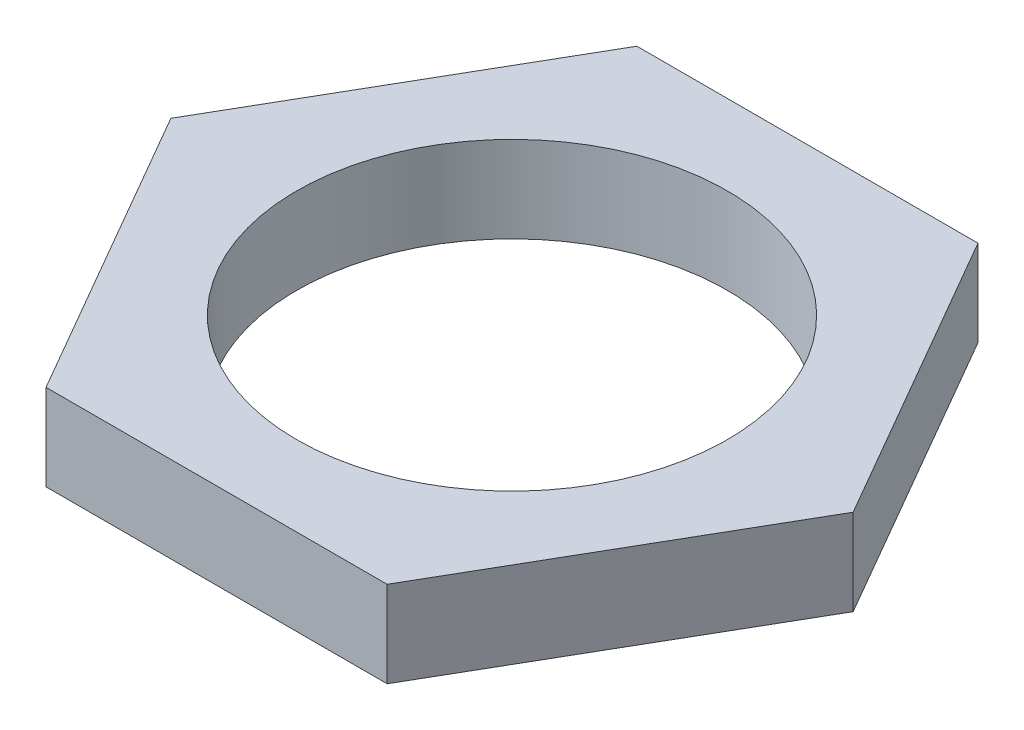
ISO-10303-21;
HEADER;
FILE_DESCRIPTION(('STEP AP214'),'2;1');
FILE_NAME('part.step','',(''),(''),'','','');
FILE_SCHEMA(('AUTOMOTIVE_DESIGN { 1 0 10303 214 1 1 1 1 }'));
ENDSEC;
DATA;
#1=APPLICATION_CONTEXT('core data for automotive mechanical design processes');
#2=APPLICATION_PROTOCOL_DEFINITION('international standard','automotive_design',2000,#1);
#3=PRODUCT_CONTEXT('',#1,'mechanical');
#4=PRODUCT('Part','Part','',(#3));
#5=PRODUCT_RELATED_PRODUCT_CATEGORY('part','',(#4));
#6=PRODUCT_DEFINITION_FORMATION('','',#4);
#7=PRODUCT_DEFINITION_CONTEXT('part definition',#1,'design');
#8=PRODUCT_DEFINITION('design','',#6,#7);
#9=PRODUCT_DEFINITION_SHAPE('','',#8);
#10=(LENGTH_UNIT() NAMED_UNIT(*) SI_UNIT(.MILLI.,.METRE.));
#11=(NAMED_UNIT(*) PLANE_ANGLE_UNIT() SI_UNIT($,.RADIAN.));
#12=(NAMED_UNIT(*) SI_UNIT($,.STERADIAN.) SOLID_ANGLE_UNIT());
#13=UNCERTAINTY_MEASURE_WITH_UNIT(LENGTH_MEASURE(1.E-05),#10,'distance_accuracy_value','');
#14=(GEOMETRIC_REPRESENTATION_CONTEXT(3) GLOBAL_UNCERTAINTY_ASSIGNED_CONTEXT((#13)) GLOBAL_UNIT_ASSIGNED_CONTEXT((#10,
#11,#12)) REPRESENTATION_CONTEXT('',''));
#15=CARTESIAN_POINT('',(0.,0.,0.));
#16=DIRECTION('',(0.,0.,1.));
#17=DIRECTION('',(1.,0.,0.));
#18=AXIS2_PLACEMENT_3D('',#15,#16,#17);
#19=CARTESIAN_POINT('',(0.,3.5,0.));
#20=DIRECTION('',(0.,1.,0.));
#21=DIRECTION('',(0.,0.,1.));
#22=AXIS2_PLACEMENT_3D('',#19,#20,#21);
#23=PLANE('',#22);
#24=DIRECTION('',(0.5,0.,0.866025403784438));
#25=VECTOR('',#24,1.);
#26=CARTESIAN_POINT('',(-13.856406460551,3.5,0.));
#27=LINE('',#26,#25);
#28=CARTESIAN_POINT('',(-13.856406460551,3.5,0.));
#29=VERTEX_POINT('',#28);
#30=CARTESIAN_POINT('',(-6.92820323027551,3.5,12.));
#31=VERTEX_POINT('',#30);
#32=EDGE_CURVE('E129',#29,#31,#27,.T.);
#33=ORIENTED_EDGE('',*,*,#32,.T.);
#34=DIRECTION('',(1.,0.,0.));
#35=VECTOR('',#34,1.);
#36=CARTESIAN_POINT('',(-6.92820323027551,3.5,12.));
#37=LINE('',#36,#35);
#38=CARTESIAN_POINT('',(6.92820323027551,3.5,12.));
#39=VERTEX_POINT('',#38);
#40=EDGE_CURVE('E87',#31,#39,#37,.T.);
#41=ORIENTED_EDGE('',*,*,#40,.T.);
#42=DIRECTION('',(0.5,0.,-0.866025403784439));
#43=VECTOR('',#42,1.);
#44=CARTESIAN_POINT('',(6.92820323027551,3.5,12.));
#45=LINE('',#44,#43);
#46=CARTESIAN_POINT('',(13.856406460551,3.5,0.));
#47=VERTEX_POINT('',#46);
#48=EDGE_CURVE('E100',#39,#47,#45,.T.);
#49=ORIENTED_EDGE('',*,*,#48,.T.);
#50=DIRECTION('',(-0.5,0.,-0.866025403784439));
#51=VECTOR('',#50,1.);
#52=CARTESIAN_POINT('',(13.856406460551,3.5,0.));
#53=LINE('',#52,#51);
#54=CARTESIAN_POINT('',(6.92820323027551,3.5,-12.));
#55=VERTEX_POINT('',#54);
#56=EDGE_CURVE('E94',#47,#55,#53,.T.);
#57=ORIENTED_EDGE('',*,*,#56,.T.);
#58=DIRECTION('',(-1.,0.,0.));
#59=VECTOR('',#58,1.);
#60=CARTESIAN_POINT('',(6.92820323027551,3.5,-12.));
#61=LINE('',#60,#59);
#62=CARTESIAN_POINT('',(-6.92820323027551,3.5,-12.));
#63=VERTEX_POINT('',#62);
#64=EDGE_CURVE('E98',#55,#63,#61,.T.);
#65=ORIENTED_EDGE('',*,*,#64,.T.);
#66=DIRECTION('',(-0.5,0.,0.866025403784439));
#67=VECTOR('',#66,1.);
#68=CARTESIAN_POINT('',(-6.92820323027551,3.5,-12.));
#69=LINE('',#68,#67);
#70=EDGE_CURVE('E50',#63,#29,#69,.T.);
#71=ORIENTED_EDGE('',*,*,#70,.T.);
#72=EDGE_LOOP('',(#33,#41,#49,#57,#65,#71));
#73=FACE_BOUND('',#72,.T.);
#74=CARTESIAN_POINT('',(0.,3.5,0.));
#75=DIRECTION('',(0.,1.,0.));
#76=DIRECTION('',(0.,0.,1.));
#77=AXIS2_PLACEMENT_3D('',#74,#75,#76);
#78=CIRCLE('',#77,8.75);
#79=CARTESIAN_POINT('',(0.,3.5,8.75));
#80=VERTEX_POINT('',#79);
#81=EDGE_CURVE('E122',#80,#80,#78,.T.);
#82=ORIENTED_EDGE('',*,*,#81,.F.);
#83=EDGE_LOOP('',(#82));
#84=FACE_BOUND('',#83,.T.);
#85=ADVANCED_FACE('F33',(#73,#84),#23,.T.);
#86=CARTESIAN_POINT('',(0.,0.,0.));
#87=DIRECTION('',(0.,1.,0.));
#88=DIRECTION('',(0.,0.,1.));
#89=AXIS2_PLACEMENT_3D('',#86,#87,#88);
#90=PLANE('',#89);
#91=DIRECTION('',(0.5,0.,0.866025403784438));
#92=VECTOR('',#91,1.);
#93=CARTESIAN_POINT('',(-13.856406460551,0.,0.));
#94=LINE('',#93,#92);
#95=CARTESIAN_POINT('',(-13.856406460551,0.,0.));
#96=VERTEX_POINT('',#95);
#97=CARTESIAN_POINT('',(-6.92820323027551,0.,12.));
#98=VERTEX_POINT('',#97);
#99=EDGE_CURVE('E118',#96,#98,#94,.T.);
#100=ORIENTED_EDGE('',*,*,#99,.F.);
#101=DIRECTION('',(-0.5,0.,0.866025403784439));
#102=VECTOR('',#101,1.);
#103=CARTESIAN_POINT('',(-6.92820323027551,0.,-12.));
#104=LINE('',#103,#102);
#105=CARTESIAN_POINT('',(-6.92820323027551,0.,-12.));
#106=VERTEX_POINT('',#105);
#107=EDGE_CURVE('E79',#106,#96,#104,.T.);
#108=ORIENTED_EDGE('',*,*,#107,.F.);
#109=DIRECTION('',(-1.,0.,0.));
#110=VECTOR('',#109,1.);
#111=CARTESIAN_POINT('',(6.92820323027551,0.,-12.));
#112=LINE('',#111,#110);
#113=CARTESIAN_POINT('',(6.92820323027551,0.,-12.));
#114=VERTEX_POINT('',#113);
#115=EDGE_CURVE('E73',#114,#106,#112,.T.);
#116=ORIENTED_EDGE('',*,*,#115,.F.);
#117=DIRECTION('',(-0.5,0.,-0.866025403784439));
#118=VECTOR('',#117,1.);
#119=CARTESIAN_POINT('',(13.856406460551,0.,0.));
#120=LINE('',#119,#118);
#121=CARTESIAN_POINT('',(13.856406460551,0.,0.));
#122=VERTEX_POINT('',#121);
#123=EDGE_CURVE('E108',#122,#114,#120,.T.);
#124=ORIENTED_EDGE('',*,*,#123,.F.);
#125=DIRECTION('',(0.5,0.,-0.866025403784439));
#126=VECTOR('',#125,1.);
#127=CARTESIAN_POINT('',(6.92820323027551,0.,12.));
#128=LINE('',#127,#126);
#129=CARTESIAN_POINT('',(6.92820323027551,0.,12.));
#130=VERTEX_POINT('',#129);
#131=EDGE_CURVE('E124',#130,#122,#128,.T.);
#132=ORIENTED_EDGE('',*,*,#131,.F.);
#133=DIRECTION('',(1.,0.,0.));
#134=VECTOR('',#133,1.);
#135=CARTESIAN_POINT('',(-6.92820323027551,0.,12.));
#136=LINE('',#135,#134);
#137=EDGE_CURVE('E121',#98,#130,#136,.T.);
#138=ORIENTED_EDGE('',*,*,#137,.F.);
#139=EDGE_LOOP('',(#100,#108,#116,#124,#132,#138));
#140=FACE_BOUND('',#139,.T.);
#141=CARTESIAN_POINT('',(0.,0.,0.));
#142=DIRECTION('',(0.,1.,0.));
#143=DIRECTION('',(0.,0.,1.));
#144=AXIS2_PLACEMENT_3D('',#141,#142,#143);
#145=CIRCLE('',#144,8.75);
#146=CARTESIAN_POINT('',(0.,0.,8.75));
#147=VERTEX_POINT('',#146);
#148=EDGE_CURVE('E222',#147,#147,#145,.T.);
#149=ORIENTED_EDGE('',*,*,#148,.T.);
#150=EDGE_LOOP('',(#149));
#151=FACE_BOUND('',#150,.T.);
#152=ADVANCED_FACE('F138',(#140,#151),#90,.F.);
#153=CARTESIAN_POINT('',(-13.856406460551,3.5,0.));
#154=DIRECTION('',(0.866025403784438,0.,-0.5));
#155=DIRECTION('',(-0.5,0.,-0.866025403784439));
#156=AXIS2_PLACEMENT_3D('',#153,#154,#155);
#157=PLANE('',#156);
#158=ORIENTED_EDGE('',*,*,#99,.T.);
#159=DIRECTION('',(0.,-1.,0.));
#160=VECTOR('',#159,1.);
#161=CARTESIAN_POINT('',(-6.92820323027551,3.5,12.));
#162=LINE('',#161,#160);
#163=EDGE_CURVE('E11',#31,#98,#162,.T.);
#164=ORIENTED_EDGE('',*,*,#163,.F.);
#165=ORIENTED_EDGE('',*,*,#32,.F.);
#166=DIRECTION('',(0.,-1.,0.));
#167=VECTOR('',#166,1.);
#168=CARTESIAN_POINT('',(-13.856406460551,3.5,0.));
#169=LINE('',#168,#167);
#170=EDGE_CURVE('E114',#29,#96,#169,.T.);
#171=ORIENTED_EDGE('',*,*,#170,.T.);
#172=EDGE_LOOP('',(#158,#164,#165,#171));
#173=FACE_BOUND('',#172,.T.);
#174=ADVANCED_FACE('F35',(#173),#157,.F.);
#175=CARTESIAN_POINT('',(-6.92820323027551,3.5,12.));
#176=DIRECTION('',(0.,0.,-1.));
#177=DIRECTION('',(-1.,0.,0.));
#178=AXIS2_PLACEMENT_3D('',#175,#176,#177);
#179=PLANE('',#178);
#180=ORIENTED_EDGE('',*,*,#137,.T.);
#181=DIRECTION('',(0.,-1.,0.));
#182=VECTOR('',#181,1.);
#183=CARTESIAN_POINT('',(6.92820323027551,3.5,12.));
#184=LINE('',#183,#182);
#185=EDGE_CURVE('E42',#39,#130,#184,.T.);
#186=ORIENTED_EDGE('',*,*,#185,.F.);
#187=ORIENTED_EDGE('',*,*,#40,.F.);
#188=ORIENTED_EDGE('',*,*,#163,.T.);
#189=EDGE_LOOP('',(#180,#186,#187,#188));
#190=FACE_BOUND('',#189,.T.);
#191=ADVANCED_FACE('F163',(#190),#179,.F.);
#192=CARTESIAN_POINT('',(6.92820323027551,3.5,12.));
#193=DIRECTION('',(-0.866025403784439,0.,-0.5));
#194=DIRECTION('',(-0.5,0.,0.866025403784439));
#195=AXIS2_PLACEMENT_3D('',#192,#193,#194);
#196=PLANE('',#195);
#197=ORIENTED_EDGE('',*,*,#131,.T.);
#198=DIRECTION('',(0.,-1.,0.));
#199=VECTOR('',#198,1.);
#200=CARTESIAN_POINT('',(13.856406460551,3.5,0.));
#201=LINE('',#200,#199);
#202=EDGE_CURVE('E109',#47,#122,#201,.T.);
#203=ORIENTED_EDGE('',*,*,#202,.F.);
#204=ORIENTED_EDGE('',*,*,#48,.F.);
#205=ORIENTED_EDGE('',*,*,#185,.T.);
#206=EDGE_LOOP('',(#197,#203,#204,#205));
#207=FACE_BOUND('',#206,.T.);
#208=ADVANCED_FACE('F135',(#207),#196,.F.);
#209=CARTESIAN_POINT('',(13.856406460551,3.5,0.));
#210=DIRECTION('',(-0.866025403784439,0.,0.5));
#211=DIRECTION('',(0.5,0.,0.866025403784439));
#212=AXIS2_PLACEMENT_3D('',#209,#210,#211);
#213=PLANE('',#212);
#214=ORIENTED_EDGE('',*,*,#123,.T.);
#215=DIRECTION('',(0.,-1.,0.));
#216=VECTOR('',#215,1.);
#217=CARTESIAN_POINT('',(6.92820323027551,3.5,-12.));
#218=LINE('',#217,#216);
#219=EDGE_CURVE('E105',#55,#114,#218,.T.);
#220=ORIENTED_EDGE('',*,*,#219,.F.);
#221=ORIENTED_EDGE('',*,*,#56,.F.);
#222=ORIENTED_EDGE('',*,*,#202,.T.);
#223=EDGE_LOOP('',(#214,#220,#221,#222));
#224=FACE_BOUND('',#223,.T.);
#225=ADVANCED_FACE('F106',(#224),#213,.F.);
#226=CARTESIAN_POINT('',(6.92820323027551,3.5,-12.));
#227=DIRECTION('',(0.,0.,1.));
#228=DIRECTION('',(1.,0.,0.));
#229=AXIS2_PLACEMENT_3D('',#226,#227,#228);
#230=PLANE('',#229);
#231=ORIENTED_EDGE('',*,*,#115,.T.);
#232=DIRECTION('',(0.,-1.,0.));
#233=VECTOR('',#232,1.);
#234=CARTESIAN_POINT('',(-6.92820323027551,3.5,-12.));
#235=LINE('',#234,#233);
#236=EDGE_CURVE('E110',#63,#106,#235,.T.);
#237=ORIENTED_EDGE('',*,*,#236,.F.);
#238=ORIENTED_EDGE('',*,*,#64,.F.);
#239=ORIENTED_EDGE('',*,*,#219,.T.);
#240=EDGE_LOOP('',(#231,#237,#238,#239));
#241=FACE_BOUND('',#240,.T.);
#242=ADVANCED_FACE('F112',(#241),#230,.F.);
#243=CARTESIAN_POINT('',(-6.92820323027551,3.5,-12.));
#244=DIRECTION('',(0.866025403784439,0.,0.5));
#245=DIRECTION('',(0.5,0.,-0.866025403784439));
#246=AXIS2_PLACEMENT_3D('',#243,#244,#245);
#247=PLANE('',#246);
#248=ORIENTED_EDGE('',*,*,#107,.T.);
#249=ORIENTED_EDGE('',*,*,#170,.F.);
#250=ORIENTED_EDGE('',*,*,#70,.F.);
#251=ORIENTED_EDGE('',*,*,#236,.T.);
#252=EDGE_LOOP('',(#248,#249,#250,#251));
#253=FACE_BOUND('',#252,.T.);
#254=ADVANCED_FACE('F143',(#253),#247,.F.);
#255=CARTESIAN_POINT('',(0.,3.5,0.));
#256=DIRECTION('',(0.,-1.,0.));
#257=DIRECTION('',(0.,0.,-1.));
#258=AXIS2_PLACEMENT_3D('',#255,#256,#257);
#259=CYLINDRICAL_SURFACE('',#258,8.75);
#260=ORIENTED_EDGE('',*,*,#81,.T.);
#261=EDGE_LOOP('',(#260));
#262=FACE_BOUND('',#261,.T.);
#263=ORIENTED_EDGE('',*,*,#148,.F.);
#264=EDGE_LOOP('',(#263));
#265=FACE_BOUND('',#264,.T.);
#266=ADVANCED_FACE('F145',(#262,#265),#259,.F.);
#267=CLOSED_SHELL('',(#85,#152,#174,#191,#208,#225,#242,#254,#266));
#268=MANIFOLD_SOLID_BREP('B2',#267);
#269=ADVANCED_BREP_SHAPE_REPRESENTATION('',(#18,#268),#14);
#270=SHAPE_DEFINITION_REPRESENTATION(#9,#269);
ENDSEC;
END-ISO-10303-21;
